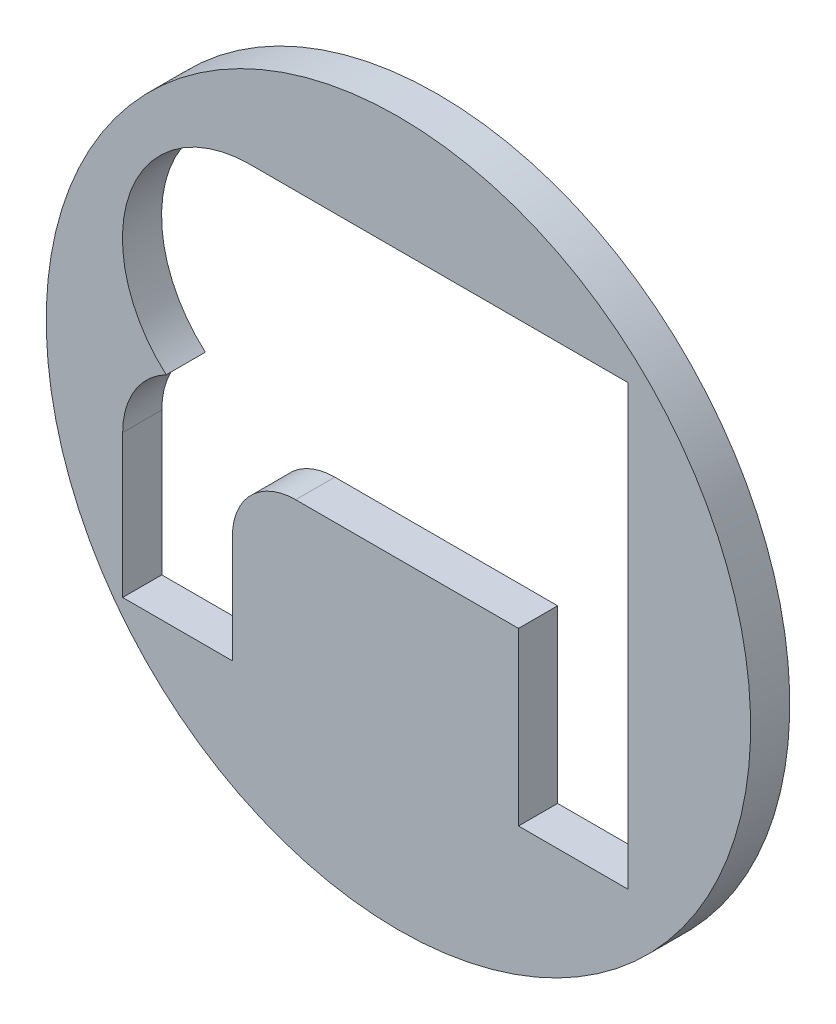
ISO-10303-21;
HEADER;
FILE_DESCRIPTION(('STEP AP214'),'2;1');
FILE_NAME('part.step','',(''),(''),'','','');
FILE_SCHEMA(('AUTOMOTIVE_DESIGN { 1 0 10303 214 1 1 1 1 }'));
ENDSEC;
DATA;
#1=APPLICATION_CONTEXT('core data for automotive mechanical design processes');
#2=APPLICATION_PROTOCOL_DEFINITION('international standard','automotive_design',2000,#1);
#3=PRODUCT_CONTEXT('',#1,'mechanical');
#4=PRODUCT('Part','Part','',(#3));
#5=PRODUCT_RELATED_PRODUCT_CATEGORY('part','',(#4));
#6=PRODUCT_DEFINITION_FORMATION('','',#4);
#7=PRODUCT_DEFINITION_CONTEXT('part definition',#1,'design');
#8=PRODUCT_DEFINITION('design','',#6,#7);
#9=PRODUCT_DEFINITION_SHAPE('','',#8);
#10=(LENGTH_UNIT() NAMED_UNIT(*) SI_UNIT(.MILLI.,.METRE.));
#11=(NAMED_UNIT(*) PLANE_ANGLE_UNIT() SI_UNIT($,.RADIAN.));
#12=(NAMED_UNIT(*) SI_UNIT($,.STERADIAN.) SOLID_ANGLE_UNIT());
#13=UNCERTAINTY_MEASURE_WITH_UNIT(LENGTH_MEASURE(1.E-05),#10,'distance_accuracy_value','');
#14=(GEOMETRIC_REPRESENTATION_CONTEXT(3) GLOBAL_UNCERTAINTY_ASSIGNED_CONTEXT((#13)) GLOBAL_UNIT_ASSIGNED_CONTEXT((#10,
#11,#12)) REPRESENTATION_CONTEXT('',''));
#15=CARTESIAN_POINT('',(0.,0.,0.));
#16=DIRECTION('',(0.,0.,1.));
#17=DIRECTION('',(1.,0.,0.));
#18=AXIS2_PLACEMENT_3D('',#15,#16,#17);
#19=CARTESIAN_POINT('',(-12.3042138671329,-1.03740541843096,-11.6112275560423));
#20=DIRECTION('',(0.,0.,1.));
#21=DIRECTION('',(0.,-1.,0.));
#22=AXIS2_PLACEMENT_3D('',#19,#20,#21);
#23=PLANE('',#22);
#24=DIRECTION('',(1.,0.,0.));
#25=VECTOR('',#24,1.);
#26=CARTESIAN_POINT('',(4.1754150146385,-1.99206829312799,-11.6112275560423));
#27=LINE('',#26,#25);
#28=CARTESIAN_POINT('',(3.67308542583852,-1.99206829312799,-11.6112275560423));
#29=VERTEX_POINT('',#28);
#30=CARTESIAN_POINT('',(4.17541501463851,-1.99206829312799,-11.6112275560423));
#31=VERTEX_POINT('',#30);
#32=EDGE_CURVE('E156',#29,#31,#27,.T.);
#33=ORIENTED_EDGE('',*,*,#32,.T.);
#34=DIRECTION('',(0.,1.,0.));
#35=VECTOR('',#34,1.);
#36=CARTESIAN_POINT('',(4.17541501463852,-2.575026346728,-11.6112275560423));
#37=LINE('',#36,#35);
#38=CARTESIAN_POINT('',(4.17541501463852,-2.575026346728,-11.6112275560423));
#39=VERTEX_POINT('',#38);
#40=EDGE_CURVE('E149',#31,#39,#37,.F.);
#41=ORIENTED_EDGE('',*,*,#40,.T.);
#42=DIRECTION('',(1.,0.,0.));
#43=VECTOR('',#42,1.);
#44=CARTESIAN_POINT('',(4.17541501463852,-2.575026346728,-11.6112275560423));
#45=LINE('',#44,#43);
#46=CARTESIAN_POINT('',(4.02960506983854,-2.575026346728,-11.6112275560423));
#47=VERTEX_POINT('',#46);
#48=EDGE_CURVE('E135',#39,#47,#45,.F.);
#49=ORIENTED_EDGE('',*,*,#48,.T.);
#50=DIRECTION('',(0.,-1.,0.));
#51=VECTOR('',#50,1.);
#52=CARTESIAN_POINT('',(4.02960506983854,-2.575026346728,-11.6112275560423));
#53=LINE('',#52,#51);
#54=CARTESIAN_POINT('',(4.02960506983854,-2.34759947952805,-11.6112275560423));
#55=VERTEX_POINT('',#54);
#56=EDGE_CURVE('E108',#47,#55,#53,.F.);
#57=ORIENTED_EDGE('',*,*,#56,.T.);
#58=DIRECTION('',(1.,0.,0.));
#59=VECTOR('',#58,1.);
#60=CARTESIAN_POINT('',(4.02960506983854,-2.34759947952805,-11.6112275560423));
#61=LINE('',#60,#59);
#62=CARTESIAN_POINT('',(3.73353904503852,-2.34759947952803,-11.6112275560423));
#63=VERTEX_POINT('',#62);
#64=EDGE_CURVE('E105',#55,#63,#61,.F.);
#65=ORIENTED_EDGE('',*,*,#64,.T.);
#66=CARTESIAN_POINT('',(3.7335390450385,-2.43169205952802,-11.6112275560423));
#67=DIRECTION('',(0.,0.,1.));
#68=DIRECTION('',(0.,-1.,0.));
#69=AXIS2_PLACEMENT_3D('',#66,#67,#68);
#70=CIRCLE('',#69,0.0840925799999864);
#71=CARTESIAN_POINT('',(3.64944646503852,-2.43169205952802,-11.6112275560423));
#72=VERTEX_POINT('',#71);
#73=EDGE_CURVE('E95',#72,#63,#70,.F.);
#74=ORIENTED_EDGE('',*,*,#73,.F.);
#75=DIRECTION('',(0.,1.,0.));
#76=VECTOR('',#75,1.);
#77=CARTESIAN_POINT('',(3.64944646503852,-2.575026346728,-11.6112275560423));
#78=LINE('',#77,#76);
#79=CARTESIAN_POINT('',(3.64944646503852,-2.575026346728,-11.6112275560423));
#80=VERTEX_POINT('',#79);
#81=EDGE_CURVE('E118',#72,#80,#78,.F.);
#82=ORIENTED_EDGE('',*,*,#81,.T.);
#83=DIRECTION('',(1.,0.,0.));
#84=VECTOR('',#83,1.);
#85=CARTESIAN_POINT('',(3.64944646503852,-2.575026346728,-11.6112275560423));
#86=LINE('',#85,#84);
#87=CARTESIAN_POINT('',(3.50363652023856,-2.575026346728,-11.6112275560423));
#88=VERTEX_POINT('',#87);
#89=EDGE_CURVE('E167',#80,#88,#86,.F.);
#90=ORIENTED_EDGE('',*,*,#89,.T.);
#91=DIRECTION('',(0.,-1.,0.));
#92=VECTOR('',#91,1.);
#93=CARTESIAN_POINT('',(3.50363652023856,-2.575026346728,-11.6112275560423));
#94=LINE('',#93,#92);
#95=CARTESIAN_POINT('',(3.50363652023856,-2.38526046392799,-11.6112275560423));
#96=VERTEX_POINT('',#95);
#97=EDGE_CURVE('E161',#88,#96,#94,.F.);
#98=ORIENTED_EDGE('',*,*,#97,.T.);
#99=CARTESIAN_POINT('',(3.61126755543856,-2.38526046392799,-11.6112275560423));
#100=DIRECTION('',(0.,0.,1.));
#101=DIRECTION('',(0.,-1.,0.));
#102=AXIS2_PLACEMENT_3D('',#99,#100,#101);
#103=CIRCLE('',#102,0.107631035200006);
#104=CARTESIAN_POINT('',(3.5615327738203,-2.28980947527088,-11.6112275560423));
#105=VERTEX_POINT('',#104);
#106=EDGE_CURVE('E191',#96,#105,#103,.F.);
#107=ORIENTED_EDGE('',*,*,#106,.T.);
#108=CARTESIAN_POINT('',(3.67308542583851,-2.16183621872796,-11.6112275560423));
#109=DIRECTION('',(0.,0.,1.));
#110=DIRECTION('',(0.,-1.,0.));
#111=AXIS2_PLACEMENT_3D('',#108,#109,#110);
#112=CIRCLE('',#111,0.169767925599904);
#113=EDGE_CURVE('E188',#105,#29,#112,.F.);
#114=ORIENTED_EDGE('',*,*,#113,.T.);
#115=EDGE_LOOP('',(#33,#41,#49,#57,#65,#74,#82,#90,#98,#107,#114));
#116=FACE_BOUND('',#115,.T.);
#117=CARTESIAN_POINT('',(3.87006322243089,-2.30646302396607,-11.6112275560423));
#118=DIRECTION('',(0.,0.,1.));
#119=DIRECTION('',(0.,-1.,0.));
#120=AXIS2_PLACEMENT_3D('',#117,#118,#119);
#121=CIRCLE('',#120,0.467999999999996);
#122=CARTESIAN_POINT('',(3.87006322243089,-2.77446302396607,-11.6112275560423));
#123=VERTEX_POINT('',#122);
#124=EDGE_CURVE('E19',#123,#123,#121,.F.);
#125=ORIENTED_EDGE('',*,*,#124,.F.);
#126=EDGE_LOOP('',(#125));
#127=FACE_BOUND('',#126,.T.);
#128=ADVANCED_FACE('F16',(#116,#127),#23,.T.);
#129=CARTESIAN_POINT('',(3.87006322243089,-2.30646302396607,-11.6112275560423));
#130=DIRECTION('',(0.,0.,1.));
#131=DIRECTION('',(0.,-1.,0.));
#132=AXIS2_PLACEMENT_3D('',#129,#130,#131);
#133=CYLINDRICAL_SURFACE('',#132,0.467999999999996);
#134=CARTESIAN_POINT('',(3.87006322243089,-2.30646302396607,-11.6632275560423));
#135=DIRECTION('',(0.,0.,1.));
#136=DIRECTION('',(0.,-1.,0.));
#137=AXIS2_PLACEMENT_3D('',#134,#135,#136);
#138=CIRCLE('',#137,0.467999999999996);
#139=CARTESIAN_POINT('',(3.87006322243089,-2.77446302396607,-11.6632275560423));
#140=VERTEX_POINT('',#139);
#141=EDGE_CURVE('E124',#140,#140,#138,.T.);
#142=ORIENTED_EDGE('',*,*,#141,.T.);
#143=EDGE_LOOP('',(#142));
#144=FACE_BOUND('',#143,.T.);
#145=ORIENTED_EDGE('',*,*,#124,.T.);
#146=EDGE_LOOP('',(#145));
#147=FACE_BOUND('',#146,.T.);
#148=ADVANCED_FACE('F295',(#144,#147),#133,.T.);
#149=CARTESIAN_POINT('',(4.02960506983854,-2.34759947952805,-11.6112275560423));
#150=DIRECTION('',(0.,-1.,0.));
#151=DIRECTION('',(1.,0.,0.));
#152=AXIS2_PLACEMENT_3D('',#149,#150,#151);
#153=PLANE('',#152);
#154=DIRECTION('',(0.,0.,1.));
#155=VECTOR('',#154,1.);
#156=CARTESIAN_POINT('',(3.73353904503853,-2.34759947952803,-11.6112275560423));
#157=LINE('',#156,#155);
#158=CARTESIAN_POINT('',(3.73353904503851,-2.34759947952804,-11.6632275560423));
#159=VERTEX_POINT('',#158);
#160=EDGE_CURVE('E102',#63,#159,#157,.F.);
#161=ORIENTED_EDGE('',*,*,#160,.F.);
#162=ORIENTED_EDGE('',*,*,#64,.F.);
#163=DIRECTION('',(0.,0.,1.));
#164=VECTOR('',#163,1.);
#165=CARTESIAN_POINT('',(4.02960506983854,-2.34759947952805,-11.6112275560423));
#166=LINE('',#165,#164);
#167=CARTESIAN_POINT('',(4.02960506983854,-2.34759947952805,-11.6632275560423));
#168=VERTEX_POINT('',#167);
#169=EDGE_CURVE('E122',#55,#168,#166,.F.);
#170=ORIENTED_EDGE('',*,*,#169,.T.);
#171=DIRECTION('',(1.,0.,0.));
#172=VECTOR('',#171,1.);
#173=CARTESIAN_POINT('',(-12.3042138671329,-2.34759947952805,-11.6632275560423));
#174=LINE('',#173,#172);
#175=EDGE_CURVE('E116',#168,#159,#174,.F.);
#176=ORIENTED_EDGE('',*,*,#175,.T.);
#177=EDGE_LOOP('',(#161,#162,#170,#176));
#178=FACE_BOUND('',#177,.T.);
#179=ADVANCED_FACE('F114',(#178),#153,.F.);
#180=CARTESIAN_POINT('',(3.7335390450385,-2.43169205952802,-11.6112275560423));
#181=DIRECTION('',(0.,0.,1.));
#182=DIRECTION('',(0.,-1.,0.));
#183=AXIS2_PLACEMENT_3D('',#180,#181,#182);
#184=CYLINDRICAL_SURFACE('',#183,0.0840925799999864);
#185=ORIENTED_EDGE('',*,*,#73,.T.);
#186=ORIENTED_EDGE('',*,*,#160,.T.);
#187=CARTESIAN_POINT('',(3.7335390450385,-2.43169205952802,-11.6632275560423));
#188=DIRECTION('',(0.,0.,1.));
#189=DIRECTION('',(0.,-1.,0.));
#190=AXIS2_PLACEMENT_3D('',#187,#188,#189);
#191=CIRCLE('',#190,0.0840925799999864);
#192=CARTESIAN_POINT('',(3.64944646503852,-2.43169205952802,-11.6632275560423));
#193=VERTEX_POINT('',#192);
#194=EDGE_CURVE('E183',#159,#193,#191,.T.);
#195=ORIENTED_EDGE('',*,*,#194,.T.);
#196=DIRECTION('',(0.,0.,1.));
#197=VECTOR('',#196,1.);
#198=CARTESIAN_POINT('',(3.64944646503852,-2.43169205952802,-11.6112275560423));
#199=LINE('',#198,#197);
#200=EDGE_CURVE('E104',#193,#72,#199,.T.);
#201=ORIENTED_EDGE('',*,*,#200,.T.);
#202=EDGE_LOOP('',(#185,#186,#195,#201));
#203=FACE_BOUND('',#202,.T.);
#204=ADVANCED_FACE('F99',(#203),#184,.T.);
#205=CARTESIAN_POINT('',(3.64944646503852,-2.575026346728,-11.6112275560423));
#206=DIRECTION('',(1.,0.,0.));
#207=DIRECTION('',(0.,1.,0.));
#208=AXIS2_PLACEMENT_3D('',#205,#206,#207);
#209=PLANE('',#208);
#210=DIRECTION('',(0.,0.,1.));
#211=VECTOR('',#210,1.);
#212=CARTESIAN_POINT('',(3.64944646503852,-2.575026346728,-11.6112275560423));
#213=LINE('',#212,#211);
#214=CARTESIAN_POINT('',(3.64944646503852,-2.575026346728,-11.6632275560423));
#215=VERTEX_POINT('',#214);
#216=EDGE_CURVE('E169',#215,#80,#213,.T.);
#217=ORIENTED_EDGE('',*,*,#216,.T.);
#218=ORIENTED_EDGE('',*,*,#81,.F.);
#219=ORIENTED_EDGE('',*,*,#200,.F.);
#220=DIRECTION('',(0.,-1.,0.));
#221=VECTOR('',#220,1.);
#222=CARTESIAN_POINT('',(3.64944646503852,-1.03740541843096,-11.6632275560423));
#223=LINE('',#222,#221);
#224=EDGE_CURVE('E185',#193,#215,#223,.T.);
#225=ORIENTED_EDGE('',*,*,#224,.T.);
#226=EDGE_LOOP('',(#217,#218,#219,#225));
#227=FACE_BOUND('',#226,.T.);
#228=ADVANCED_FACE('F216',(#227),#209,.F.);
#229=CARTESIAN_POINT('',(3.64944646503852,-2.575026346728,-11.6112275560423));
#230=DIRECTION('',(0.,-1.,0.));
#231=DIRECTION('',(1.,0.,0.));
#232=AXIS2_PLACEMENT_3D('',#229,#230,#231);
#233=PLANE('',#232);
#234=DIRECTION('',(0.,0.,1.));
#235=VECTOR('',#234,1.);
#236=CARTESIAN_POINT('',(3.50363652023856,-2.575026346728,-11.6112275560423));
#237=LINE('',#236,#235);
#238=CARTESIAN_POINT('',(3.50363652023856,-2.575026346728,-11.6632275560423));
#239=VERTEX_POINT('',#238);
#240=EDGE_CURVE('E164',#239,#88,#237,.T.);
#241=ORIENTED_EDGE('',*,*,#240,.T.);
#242=ORIENTED_EDGE('',*,*,#89,.F.);
#243=ORIENTED_EDGE('',*,*,#216,.F.);
#244=DIRECTION('',(1.,0.,0.));
#245=VECTOR('',#244,1.);
#246=CARTESIAN_POINT('',(-12.3042138671329,-2.575026346728,-11.6632275560423));
#247=LINE('',#246,#245);
#248=EDGE_CURVE('E207',#215,#239,#247,.F.);
#249=ORIENTED_EDGE('',*,*,#248,.T.);
#250=EDGE_LOOP('',(#241,#242,#243,#249));
#251=FACE_BOUND('',#250,.T.);
#252=ADVANCED_FACE('F221',(#251),#233,.F.);
#253=CARTESIAN_POINT('',(3.50363652023856,-2.575026346728,-11.6112275560423));
#254=DIRECTION('',(-1.,0.,0.));
#255=DIRECTION('',(0.,-1.,0.));
#256=AXIS2_PLACEMENT_3D('',#253,#254,#255);
#257=PLANE('',#256);
#258=DIRECTION('',(0.,0.,1.));
#259=VECTOR('',#258,1.);
#260=CARTESIAN_POINT('',(3.50363652023855,-2.38526046392799,-11.6112275560423));
#261=LINE('',#260,#259);
#262=CARTESIAN_POINT('',(3.50363652023856,-2.38526046392799,-11.6632275560423));
#263=VERTEX_POINT('',#262);
#264=EDGE_CURVE('E163',#263,#96,#261,.T.);
#265=ORIENTED_EDGE('',*,*,#264,.T.);
#266=ORIENTED_EDGE('',*,*,#97,.F.);
#267=ORIENTED_EDGE('',*,*,#240,.F.);
#268=DIRECTION('',(0.,-1.,0.));
#269=VECTOR('',#268,1.);
#270=CARTESIAN_POINT('',(3.50363652023856,-1.03740541843096,-11.6632275560423));
#271=LINE('',#270,#269);
#272=EDGE_CURVE('E182',#239,#263,#271,.F.);
#273=ORIENTED_EDGE('',*,*,#272,.T.);
#274=EDGE_LOOP('',(#265,#266,#267,#273));
#275=FACE_BOUND('',#274,.T.);
#276=ADVANCED_FACE('F284',(#275),#257,.F.);
#277=CARTESIAN_POINT('',(3.61126755543856,-2.38526046392799,-11.6112275560423));
#278=DIRECTION('',(0.,0.,1.));
#279=DIRECTION('',(0.,-1.,0.));
#280=AXIS2_PLACEMENT_3D('',#277,#278,#279);
#281=CYLINDRICAL_SURFACE('',#280,0.107631035200006);
#282=DIRECTION('',(0.,0.,1.));
#283=VECTOR('',#282,1.);
#284=CARTESIAN_POINT('',(3.56153277382026,-2.28980947527084,-11.6112275560423));
#285=LINE('',#284,#283);
#286=CARTESIAN_POINT('',(3.5615327738203,-2.28980947527088,-11.6632275560423));
#287=VERTEX_POINT('',#286);
#288=EDGE_CURVE('E190',#287,#105,#285,.T.);
#289=ORIENTED_EDGE('',*,*,#288,.T.);
#290=ORIENTED_EDGE('',*,*,#106,.F.);
#291=ORIENTED_EDGE('',*,*,#264,.F.);
#292=CARTESIAN_POINT('',(3.61126755543856,-2.38526046392799,-11.6632275560423));
#293=DIRECTION('',(0.,0.,1.));
#294=DIRECTION('',(0.,-1.,0.));
#295=AXIS2_PLACEMENT_3D('',#292,#293,#294);
#296=CIRCLE('',#295,0.107631035200006);
#297=EDGE_CURVE('E179',#263,#287,#296,.F.);
#298=ORIENTED_EDGE('',*,*,#297,.T.);
#299=EDGE_LOOP('',(#289,#290,#291,#298));
#300=FACE_BOUND('',#299,.T.);
#301=ADVANCED_FACE('F280',(#300),#281,.F.);
#302=CARTESIAN_POINT('',(3.67308542583851,-2.16183621872796,-11.6112275560423));
#303=DIRECTION('',(0.,0.,1.));
#304=DIRECTION('',(0.,-1.,0.));
#305=AXIS2_PLACEMENT_3D('',#302,#303,#304);
#306=CYLINDRICAL_SURFACE('',#305,0.169767925599904);
#307=ORIENTED_EDGE('',*,*,#288,.F.);
#308=CARTESIAN_POINT('',(3.67308542583851,-2.16183621872796,-11.6632275560423));
#309=DIRECTION('',(0.,0.,1.));
#310=DIRECTION('',(0.,-1.,0.));
#311=AXIS2_PLACEMENT_3D('',#308,#309,#310);
#312=CIRCLE('',#311,0.169767925599904);
#313=CARTESIAN_POINT('',(3.67308542583852,-1.99206829312816,-11.6632275560423));
#314=VERTEX_POINT('',#313);
#315=EDGE_CURVE('E175',#287,#314,#312,.F.);
#316=ORIENTED_EDGE('',*,*,#315,.T.);
#317=DIRECTION('',(0.,0.,1.));
#318=VECTOR('',#317,1.);
#319=CARTESIAN_POINT('',(3.67308542583854,-1.99206829312799,-11.6112275560423));
#320=LINE('',#319,#318);
#321=EDGE_CURVE('E158',#314,#29,#320,.T.);
#322=ORIENTED_EDGE('',*,*,#321,.T.);
#323=ORIENTED_EDGE('',*,*,#113,.F.);
#324=EDGE_LOOP('',(#307,#316,#322,#323));
#325=FACE_BOUND('',#324,.T.);
#326=ADVANCED_FACE('F277',(#325),#306,.F.);
#327=CARTESIAN_POINT('',(4.1754150146385,-1.99206829312799,-11.6112275560423));
#328=DIRECTION('',(0.,1.,0.));
#329=DIRECTION('',(0.,0.,1.));
#330=AXIS2_PLACEMENT_3D('',#327,#328,#329);
#331=PLANE('',#330);
#332=DIRECTION('',(0.,0.,-1.));
#333=VECTOR('',#332,1.);
#334=CARTESIAN_POINT('',(4.17541501463852,-1.99206829312799,-11.6112275560423));
#335=LINE('',#334,#333);
#336=CARTESIAN_POINT('',(4.17541501463851,-1.99206829312822,-11.6632275560423));
#337=VERTEX_POINT('',#336);
#338=EDGE_CURVE('E153',#337,#31,#335,.F.);
#339=ORIENTED_EDGE('',*,*,#338,.T.);
#340=ORIENTED_EDGE('',*,*,#32,.F.);
#341=ORIENTED_EDGE('',*,*,#321,.F.);
#342=DIRECTION('',(1.,0.,0.));
#343=VECTOR('',#342,1.);
#344=CARTESIAN_POINT('',(-12.3042138671329,-1.99206829312833,-11.6632275560423));
#345=LINE('',#344,#343);
#346=EDGE_CURVE('E178',#314,#337,#345,.T.);
#347=ORIENTED_EDGE('',*,*,#346,.T.);
#348=EDGE_LOOP('',(#339,#340,#341,#347));
#349=FACE_BOUND('',#348,.T.);
#350=ADVANCED_FACE('F253',(#349),#331,.F.);
#351=CARTESIAN_POINT('',(4.17541501463852,-2.575026346728,-11.6112275560423));
#352=DIRECTION('',(1.,0.,0.));
#353=DIRECTION('',(0.,0.,-1.));
#354=AXIS2_PLACEMENT_3D('',#351,#352,#353);
#355=PLANE('',#354);
#356=DIRECTION('',(0.,0.,1.));
#357=VECTOR('',#356,1.);
#358=CARTESIAN_POINT('',(4.17541501463852,-2.575026346728,-11.6112275560423));
#359=LINE('',#358,#357);
#360=CARTESIAN_POINT('',(4.17541501463851,-2.575026346728,-11.6632275560423));
#361=VERTEX_POINT('',#360);
#362=EDGE_CURVE('E139',#361,#39,#359,.T.);
#363=ORIENTED_EDGE('',*,*,#362,.T.);
#364=ORIENTED_EDGE('',*,*,#40,.F.);
#365=ORIENTED_EDGE('',*,*,#338,.F.);
#366=DIRECTION('',(0.,-1.,0.));
#367=VECTOR('',#366,1.);
#368=CARTESIAN_POINT('',(4.1754150146385,-1.03740541843096,-11.6632275560423));
#369=LINE('',#368,#367);
#370=EDGE_CURVE('E144',#337,#361,#369,.T.);
#371=ORIENTED_EDGE('',*,*,#370,.T.);
#372=EDGE_LOOP('',(#363,#364,#365,#371));
#373=FACE_BOUND('',#372,.T.);
#374=ADVANCED_FACE('F258',(#373),#355,.F.);
#375=CARTESIAN_POINT('',(4.17541501463852,-2.575026346728,-11.6112275560423));
#376=DIRECTION('',(0.,-1.,0.));
#377=DIRECTION('',(1.,0.,0.));
#378=AXIS2_PLACEMENT_3D('',#375,#376,#377);
#379=PLANE('',#378);
#380=DIRECTION('',(0.,0.,1.));
#381=VECTOR('',#380,1.);
#382=CARTESIAN_POINT('',(4.02960506983854,-2.575026346728,-11.6112275560423));
#383=LINE('',#382,#381);
#384=CARTESIAN_POINT('',(4.02960506983854,-2.575026346728,-11.6632275560423));
#385=VERTEX_POINT('',#384);
#386=EDGE_CURVE('E33',#385,#47,#383,.T.);
#387=ORIENTED_EDGE('',*,*,#386,.T.);
#388=ORIENTED_EDGE('',*,*,#48,.F.);
#389=ORIENTED_EDGE('',*,*,#362,.F.);
#390=DIRECTION('',(1.,0.,0.));
#391=VECTOR('',#390,1.);
#392=CARTESIAN_POINT('',(-12.3042138671329,-2.575026346728,-11.6632275560423));
#393=LINE('',#392,#391);
#394=EDGE_CURVE('E25',#361,#385,#393,.F.);
#395=ORIENTED_EDGE('',*,*,#394,.T.);
#396=EDGE_LOOP('',(#387,#388,#389,#395));
#397=FACE_BOUND('',#396,.T.);
#398=ADVANCED_FACE('F260',(#397),#379,.F.);
#399=CARTESIAN_POINT('',(4.02960506983854,-2.575026346728,-11.6112275560423));
#400=DIRECTION('',(-1.,0.,0.));
#401=DIRECTION('',(0.,-1.,0.));
#402=AXIS2_PLACEMENT_3D('',#399,#400,#401);
#403=PLANE('',#402);
#404=ORIENTED_EDGE('',*,*,#169,.F.);
#405=ORIENTED_EDGE('',*,*,#56,.F.);
#406=ORIENTED_EDGE('',*,*,#386,.F.);
#407=DIRECTION('',(0.,-1.,0.));
#408=VECTOR('',#407,1.);
#409=CARTESIAN_POINT('',(4.02960506983854,-1.03740541843096,-11.6632275560423));
#410=LINE('',#409,#408);
#411=EDGE_CURVE('E11',#385,#168,#410,.F.);
#412=ORIENTED_EDGE('',*,*,#411,.T.);
#413=EDGE_LOOP('',(#404,#405,#406,#412));
#414=FACE_BOUND('',#413,.T.);
#415=ADVANCED_FACE('F262',(#414),#403,.F.);
#416=CARTESIAN_POINT('',(-12.3042138671329,-1.03740541843096,-11.6632275560423));
#417=DIRECTION('',(0.,0.,1.));
#418=DIRECTION('',(0.,-1.,0.));
#419=AXIS2_PLACEMENT_3D('',#416,#417,#418);
#420=PLANE('',#419);
#421=ORIENTED_EDGE('',*,*,#394,.F.);
#422=ORIENTED_EDGE('',*,*,#370,.F.);
#423=ORIENTED_EDGE('',*,*,#346,.F.);
#424=ORIENTED_EDGE('',*,*,#315,.F.);
#425=ORIENTED_EDGE('',*,*,#297,.F.);
#426=ORIENTED_EDGE('',*,*,#272,.F.);
#427=ORIENTED_EDGE('',*,*,#248,.F.);
#428=ORIENTED_EDGE('',*,*,#224,.F.);
#429=ORIENTED_EDGE('',*,*,#194,.F.);
#430=ORIENTED_EDGE('',*,*,#175,.F.);
#431=ORIENTED_EDGE('',*,*,#411,.F.);
#432=EDGE_LOOP('',(#421,#422,#423,#424,#425,#426,#427,#428,#429,#430,#431));
#433=FACE_BOUND('',#432,.T.);
#434=ORIENTED_EDGE('',*,*,#141,.F.);
#435=EDGE_LOOP('',(#434));
#436=FACE_BOUND('',#435,.T.);
#437=ADVANCED_FACE('F225',(#433,#436),#420,.F.);
#438=CLOSED_SHELL('',(#128,#148,#179,#204,#228,#252,#276,#301,#326,#350,#374,#398,#415,#437));
#439=MANIFOLD_SOLID_BREP('B1',#438);
#440=ADVANCED_BREP_SHAPE_REPRESENTATION('',(#18,#439),#14);
#441=SHAPE_DEFINITION_REPRESENTATION(#9,#440);
ENDSEC;
END-ISO-10303-21;
